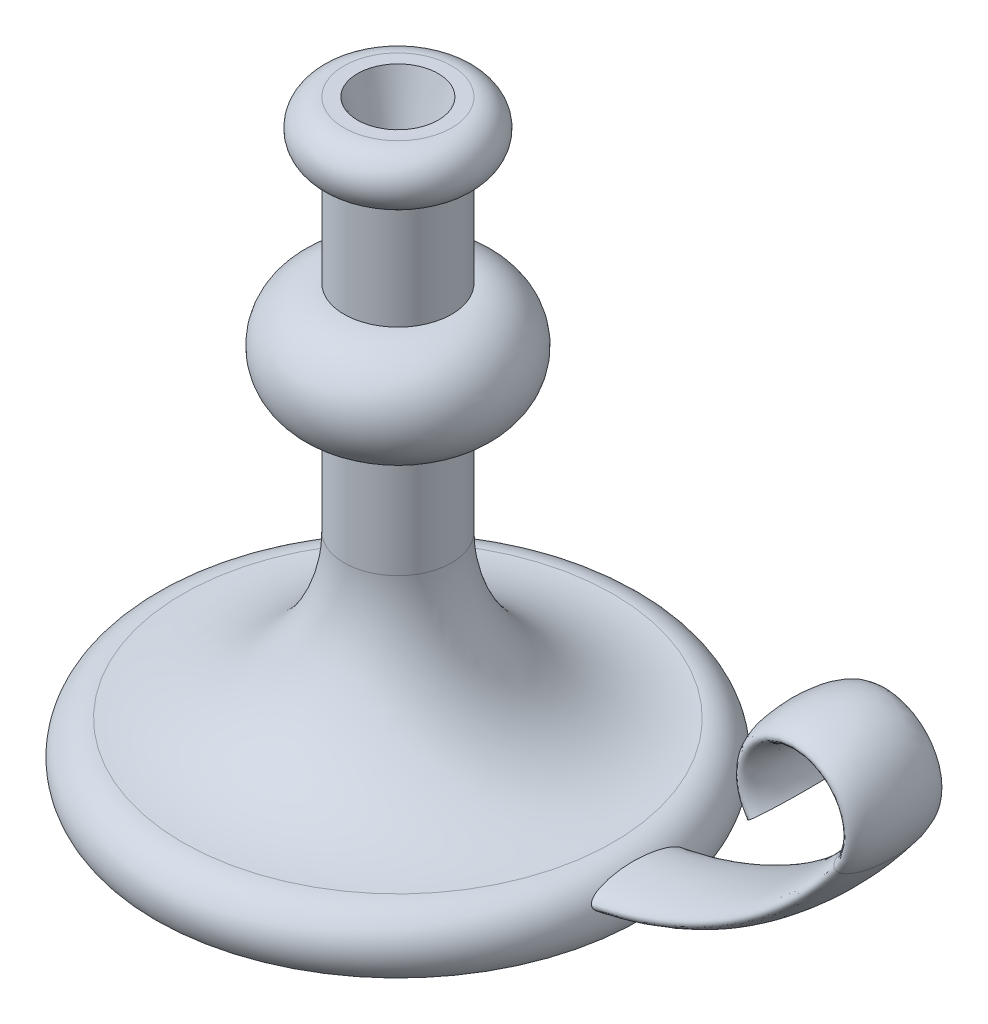
ISO-10303-21;
HEADER;
FILE_DESCRIPTION(('STEP AP214'),'2;1');
FILE_NAME('part.step','',(''),(''),'','','');
FILE_SCHEMA(('AUTOMOTIVE_DESIGN { 1 0 10303 214 1 1 1 1 }'));
ENDSEC;
DATA;
#1=APPLICATION_CONTEXT('core data for automotive mechanical design processes');
#2=APPLICATION_PROTOCOL_DEFINITION('international standard','automotive_design',2000,#1);
#3=PRODUCT_CONTEXT('',#1,'mechanical');
#4=PRODUCT('Part','Part','',(#3));
#5=PRODUCT_RELATED_PRODUCT_CATEGORY('part','',(#4));
#6=PRODUCT_DEFINITION_FORMATION('','',#4);
#7=PRODUCT_DEFINITION_CONTEXT('part definition',#1,'design');
#8=PRODUCT_DEFINITION('design','',#6,#7);
#9=PRODUCT_DEFINITION_SHAPE('','',#8);
#10=(LENGTH_UNIT() NAMED_UNIT(*) SI_UNIT(.MILLI.,.METRE.));
#11=(NAMED_UNIT(*) PLANE_ANGLE_UNIT() SI_UNIT($,.RADIAN.));
#12=(NAMED_UNIT(*) SI_UNIT($,.STERADIAN.) SOLID_ANGLE_UNIT());
#13=UNCERTAINTY_MEASURE_WITH_UNIT(LENGTH_MEASURE(1.E-05),#10,'distance_accuracy_value','');
#14=(GEOMETRIC_REPRESENTATION_CONTEXT(3) GLOBAL_UNCERTAINTY_ASSIGNED_CONTEXT((#13)) GLOBAL_UNIT_ASSIGNED_CONTEXT((#10,
#11,#12)) REPRESENTATION_CONTEXT('',''));
#15=CARTESIAN_POINT('',(0.,0.,0.));
#16=DIRECTION('',(0.,0.,1.));
#17=DIRECTION('',(1.,0.,0.));
#18=AXIS2_PLACEMENT_3D('',#15,#16,#17);
#19=CARTESIAN_POINT('',(90.,0.,0.));
#20=DIRECTION('',(0.,-1.,0.));
#21=DIRECTION('',(0.,0.,-1.));
#22=AXIS2_PLACEMENT_3D('',#19,#20,#21);
#23=PLANE('',#22);
#24=CARTESIAN_POINT('',(0.,0.,0.));
#25=DIRECTION('',(0.,-1.,0.));
#26=DIRECTION('',(0.,0.,-1.));
#27=AXIS2_PLACEMENT_3D('',#24,#25,#26);
#28=CIRCLE('',#27,90.);
#29=CARTESIAN_POINT('',(0.,0.,-90.));
#30=VERTEX_POINT('',#29);
#31=EDGE_CURVE('E77',#30,#30,#28,.T.);
#32=ORIENTED_EDGE('',*,*,#31,.T.);
#33=EDGE_LOOP('',(#32));
#34=FACE_BOUND('',#33,.T.);
#35=ADVANCED_FACE('F37',(#34),#23,.T.);
#36=CARTESIAN_POINT('',(0.,220.,0.));
#37=DIRECTION('',(0.,1.,0.));
#38=DIRECTION('',(0.,0.,1.));
#39=AXIS2_PLACEMENT_3D('',#36,#37,#38);
#40=PLANE('',#39);
#41=CARTESIAN_POINT('',(0.,220.,0.));
#42=DIRECTION('',(0.,1.,0.));
#43=DIRECTION('',(0.,0.,1.));
#44=AXIS2_PLACEMENT_3D('',#41,#42,#43);
#45=CIRCLE('',#44,15.);
#46=CARTESIAN_POINT('',(0.,220.,15.));
#47=VERTEX_POINT('',#46);
#48=EDGE_CURVE('E93',#47,#47,#45,.T.);
#49=ORIENTED_EDGE('',*,*,#48,.F.);
#50=EDGE_LOOP('',(#49));
#51=FACE_BOUND('',#50,.T.);
#52=CARTESIAN_POINT('',(0.,220.,0.));
#53=DIRECTION('',(0.,-1.,0.));
#54=DIRECTION('',(0.,0.,-1.));
#55=AXIS2_PLACEMENT_3D('',#52,#53,#54);
#56=CIRCLE('',#55,20.);
#57=CARTESIAN_POINT('',(0.,220.,-20.));
#58=VERTEX_POINT('',#57);
#59=EDGE_CURVE('E49',#58,#58,#56,.T.);
#60=ORIENTED_EDGE('',*,*,#59,.F.);
#61=EDGE_LOOP('',(#60));
#62=FACE_BOUND('',#61,.T.);
#63=ADVANCED_FACE('F100',(#51,#62),#40,.T.);
#64=CARTESIAN_POINT('',(0.,210.,0.));
#65=DIRECTION('',(0.,-1.,0.));
#66=DIRECTION('',(0.,0.,-1.));
#67=AXIS2_PLACEMENT_3D('',#64,#65,#66);
#68=TOROIDAL_SURFACE('',#67,20.,9.99999999999999);
#69=ORIENTED_EDGE('',*,*,#59,.T.);
#70=EDGE_LOOP('',(#69));
#71=FACE_BOUND('',#70,.T.);
#72=CARTESIAN_POINT('',(0.,200.,0.));
#73=DIRECTION('',(0.,-1.,0.));
#74=DIRECTION('',(0.,0.,-1.));
#75=AXIS2_PLACEMENT_3D('',#72,#73,#74);
#76=CIRCLE('',#75,20.);
#77=CARTESIAN_POINT('',(0.,200.,-20.));
#78=VERTEX_POINT('',#77);
#79=EDGE_CURVE('E54',#78,#78,#76,.T.);
#80=ORIENTED_EDGE('',*,*,#79,.F.);
#81=EDGE_LOOP('',(#80));
#82=FACE_BOUND('',#81,.T.);
#83=ADVANCED_FACE('F103',(#71,#82),#68,.T.);
#84=CARTESIAN_POINT('',(0.,0.,0.));
#85=DIRECTION('',(0.,-1.,0.));
#86=DIRECTION('',(0.,0.,-1.));
#87=AXIS2_PLACEMENT_3D('',#84,#85,#86);
#88=CYLINDRICAL_SURFACE('',#87,20.);
#89=ORIENTED_EDGE('',*,*,#79,.T.);
#90=EDGE_LOOP('',(#89));
#91=FACE_BOUND('',#90,.T.);
#92=CARTESIAN_POINT('',(0.,160.,0.));
#93=DIRECTION('',(0.,-1.,0.));
#94=DIRECTION('',(0.,0.,-1.));
#95=AXIS2_PLACEMENT_3D('',#92,#93,#94);
#96=CIRCLE('',#95,20.);
#97=CARTESIAN_POINT('',(0.,160.,-20.));
#98=VERTEX_POINT('',#97);
#99=EDGE_CURVE('E59',#98,#98,#96,.T.);
#100=ORIENTED_EDGE('',*,*,#99,.F.);
#101=EDGE_LOOP('',(#100));
#102=FACE_BOUND('',#101,.T.);
#103=ADVANCED_FACE('F108',(#91,#102),#88,.T.);
#104=CARTESIAN_POINT('',(0.,140.,0.));
#105=DIRECTION('',(0.,-1.,0.));
#106=DIRECTION('',(0.,0.,-1.));
#107=AXIS2_PLACEMENT_3D('',#104,#105,#106);
#108=TOROIDAL_SURFACE('',#107,20.,20.);
#109=ORIENTED_EDGE('',*,*,#99,.T.);
#110=EDGE_LOOP('',(#109));
#111=FACE_BOUND('',#110,.T.);
#112=CARTESIAN_POINT('',(0.,120.,0.));
#113=DIRECTION('',(0.,-1.,0.));
#114=DIRECTION('',(0.,0.,-1.));
#115=AXIS2_PLACEMENT_3D('',#112,#113,#114);
#116=CIRCLE('',#115,20.);
#117=CARTESIAN_POINT('',(0.,120.,-20.));
#118=VERTEX_POINT('',#117);
#119=EDGE_CURVE('E65',#118,#118,#116,.T.);
#120=ORIENTED_EDGE('',*,*,#119,.F.);
#121=EDGE_LOOP('',(#120));
#122=FACE_BOUND('',#121,.T.);
#123=ADVANCED_FACE('F114',(#111,#122),#108,.T.);
#124=CARTESIAN_POINT('',(0.,0.,0.));
#125=DIRECTION('',(0.,-1.,0.));
#126=DIRECTION('',(0.,0.,-1.));
#127=AXIS2_PLACEMENT_3D('',#124,#125,#126);
#128=CYLINDRICAL_SURFACE('',#127,20.);
#129=ORIENTED_EDGE('',*,*,#119,.T.);
#130=EDGE_LOOP('',(#129));
#131=FACE_BOUND('',#130,.T.);
#132=CARTESIAN_POINT('',(0.,80.,0.));
#133=DIRECTION('',(0.,-1.,0.));
#134=DIRECTION('',(0.,0.,-1.));
#135=AXIS2_PLACEMENT_3D('',#132,#133,#134);
#136=CIRCLE('',#135,20.);
#137=CARTESIAN_POINT('',(0.,80.,-20.));
#138=VERTEX_POINT('',#137);
#139=EDGE_CURVE('E69',#138,#138,#136,.T.);
#140=ORIENTED_EDGE('',*,*,#139,.F.);
#141=EDGE_LOOP('',(#140));
#142=FACE_BOUND('',#141,.T.);
#143=ADVANCED_FACE('F118',(#131,#142),#128,.T.);
#144=CARTESIAN_POINT('',(0.,80.,0.));
#145=DIRECTION('',(0.,-1.,0.));
#146=DIRECTION('',(0.,0.,-1.));
#147=AXIS2_PLACEMENT_3D('',#144,#145,#146);
#148=TOROIDAL_SURFACE('',#147,80.,60.);
#149=ORIENTED_EDGE('',*,*,#139,.T.);
#150=EDGE_LOOP('',(#149));
#151=FACE_BOUND('',#150,.T.);
#152=CARTESIAN_POINT('',(0.,20.,0.));
#153=DIRECTION('',(0.,-1.,0.));
#154=DIRECTION('',(0.,0.,-1.));
#155=AXIS2_PLACEMENT_3D('',#152,#153,#154);
#156=CIRCLE('',#155,80.);
#157=CARTESIAN_POINT('',(0.,20.,-80.));
#158=VERTEX_POINT('',#157);
#159=EDGE_CURVE('E73',#158,#158,#156,.T.);
#160=ORIENTED_EDGE('',*,*,#159,.F.);
#161=EDGE_LOOP('',(#160));
#162=FACE_BOUND('',#161,.T.);
#163=ADVANCED_FACE('F122',(#151,#162),#148,.F.);
#164=CARTESIAN_POINT('',(0.,7.50000000000001,0.));
#165=DIRECTION('',(0.,-1.,0.));
#166=DIRECTION('',(0.,0.,-1.));
#167=AXIS2_PLACEMENT_3D('',#164,#165,#166);
#168=TOROIDAL_SURFACE('',#167,80.,12.5);
#169=CARTESIAN_POINT('',(89.5597422043342,12.9414346567555,-17.5));
#170=CARTESIAN_POINT('',(89.5390618403562,12.9834100865229,-17.4999996776707));
#171=CARTESIAN_POINT('',(89.5184817634659,13.0254349004938,-17.4978446678338));
#172=CARTESIAN_POINT('',(89.4776811982744,13.1092324497794,-17.4892861575811));
#173=CARTESIAN_POINT('',(89.457460843071,13.1510050881611,-17.4828811168849));
#174=CARTESIAN_POINT('',(89.397540281121,13.2754779151414,-17.4575154450276));
#175=CARTESIAN_POINT('',(89.3585808220613,13.357332519418,-17.4324042670614));
#176=CARTESIAN_POINT('',(89.2734407804368,13.537917999339,-17.3597430943198));
#177=CARTESIAN_POINT('',(89.2281116968574,13.6353152430682,-17.3079906529225));
#178=CARTESIAN_POINT('',(89.1421567137609,13.8217570109409,-17.1881654215547));
#179=CARTESIAN_POINT('',(89.10154096816,13.9107834263932,-17.1200583326704));
#180=CARTESIAN_POINT('',(89.0298799325305,14.0690063055582,-16.9825317839868));
#181=CARTESIAN_POINT('',(88.9982856031081,14.1392491335227,-16.9145677994464));
#182=CARTESIAN_POINT('',(88.9378435588022,14.2742914925202,-16.7722502997375));
#183=CARTESIAN_POINT('',(88.9089980734781,14.3390866000317,-16.6978916893925));
#184=CARTESIAN_POINT('',(88.8536099995593,14.4639626152392,-16.5442177801531));
#185=CARTESIAN_POINT('',(88.8270733532936,14.5240313225779,-16.4648905452803));
#186=CARTESIAN_POINT('',(88.7760376587064,14.6398576639347,-16.3025863942461));
#187=CARTESIAN_POINT('',(88.7515379613228,14.6956166708123,-16.2196106536441));
#188=CARTESIAN_POINT('',(88.704732820549,14.8023169553036,-16.052427362784));
#189=CARTESIAN_POINT('',(88.6823939519366,14.8533308765833,-15.9682752160745));
#190=CARTESIAN_POINT('',(88.639155365759,14.9521540950118,-15.7977416210759));
#191=CARTESIAN_POINT('',(88.6182558899722,14.9999628537458,-15.711359801597));
#192=CARTESIAN_POINT('',(88.5573681790009,15.1392585624724,-15.4492483073625));
#193=CARTESIAN_POINT('',(88.5192579811328,15.2264609786255,-15.2707999543232));
#194=CARTESIAN_POINT('',(88.4468979005836,15.3916731276291,-14.9088289385944));
#195=CARTESIAN_POINT('',(88.4126513155026,15.4696750103546,-14.725302105289));
#196=CARTESIAN_POINT('',(88.347139159504,15.6182965032923,-14.3538259785736));
#197=CARTESIAN_POINT('',(88.3158872528146,15.6888824046966,-14.1658608782527));
#198=CARTESIAN_POINT('',(88.2560127035516,15.8233792512431,-13.7874003918539));
#199=CARTESIAN_POINT('',(88.2273872233002,15.8872974109117,-13.5969079973402));
#200=CARTESIAN_POINT('',(88.1723348827448,16.0094159388249,-13.213849673779));
#201=CARTESIAN_POINT('',(88.1459074726896,16.0676177374301,-13.021284276893));
#202=CARTESIAN_POINT('',(88.0884248304702,16.1932687928886,-12.5849658119247));
#203=CARTESIAN_POINT('',(88.0579162002184,16.2592725226906,-12.3407253521734));
#204=CARTESIAN_POINT('',(87.9994625659013,16.3844358500305,-11.8501803460781));
#205=CARTESIAN_POINT('',(87.9715178234088,16.4435947494061,-11.6038755919222));
#206=CARTESIAN_POINT('',(87.9178897421858,16.5558889779776,-11.1095299870479));
#207=CARTESIAN_POINT('',(87.8922075114269,16.6090213595568,-10.8614883492399));
#208=CARTESIAN_POINT('',(87.8429155378603,16.7098546386226,-10.3640943607017));
#209=CARTESIAN_POINT('',(87.8193058942812,16.7575552760879,-10.114741947821));
#210=CARTESIAN_POINT('',(87.7514718906047,16.8930622945828,-9.36631396644898));
#211=CARTESIAN_POINT('',(87.710111419914,16.97354616682,-8.86564202060313));
#212=CARTESIAN_POINT('',(87.6344118706353,17.1178657179368,-7.86153551840228));
#213=CARTESIAN_POINT('',(87.6000713341079,17.1817048544489,-7.35810155802564));
#214=CARTESIAN_POINT('',(87.5383679228554,17.2943697092708,-6.35225136111874));
#215=CARTESIAN_POINT('',(87.5109639050818,17.3432843238913,-5.84984753787557));
#216=CARTESIAN_POINT('',(87.4628391630611,17.4279603163538,-4.84354228831011));
#217=CARTESIAN_POINT('',(87.4421195253372,17.4637195559667,-4.33964063194091));
#218=CARTESIAN_POINT('',(87.4074386787955,17.5229738360405,-3.33084363886015));
#219=CARTESIAN_POINT('',(87.3934780874882,17.5464677559495,-2.82594821558682));
#220=CARTESIAN_POINT('',(87.3724154174235,17.5817273168609,-1.81615213380805));
#221=CARTESIAN_POINT('',(87.3653059747339,17.5935055508652,-1.31125206554522));
#222=CARTESIAN_POINT('',(87.3579750479625,17.6056484066489,-0.301318309132925));
#223=CARTESIAN_POINT('',(87.3577528582351,17.6060141977103,0.203715360026074));
#224=CARTESIAN_POINT('',(87.3641963426439,17.5953454261039,1.21356726554167));
#225=CARTESIAN_POINT('',(87.3708612610896,17.5843121142069,1.71838551945507));
#226=CARTESIAN_POINT('',(87.3886163883338,17.5546163065411,2.60695068649851));
#227=CARTESIAN_POINT('',(87.3982690399213,17.5384060734754,2.99081046478837));
#228=CARTESIAN_POINT('',(87.4214966880659,17.4990063104014,3.7580700278571));
#229=CARTESIAN_POINT('',(87.435071823598,17.4758165331044,4.14146979585426));
#230=CARTESIAN_POINT('',(87.4661109016121,17.4221255760208,4.90767543763207));
#231=CARTESIAN_POINT('',(87.4835755913649,17.3916229911934,5.29048118303757));
#232=CARTESIAN_POINT('',(87.52247652696,17.3226675403927,6.05728766608034));
#233=CARTESIAN_POINT('',(87.5439339089184,17.2841722314846,6.4412835383544));
#234=CARTESIAN_POINT('',(87.5907685418077,17.1987228636429,7.20803081067555));
#235=CARTESIAN_POINT('',(87.6161451191905,17.1517702579396,7.59078241304229));
#236=CARTESIAN_POINT('',(87.6708875244928,17.0486132676472,8.35453102594113));
#237=CARTESIAN_POINT('',(87.7002509792864,16.9924143825779,8.73552894189134));
#238=CARTESIAN_POINT('',(87.7555693385742,16.8844873931685,9.40362807317345));
#239=CARTESIAN_POINT('',(87.7806318626291,16.8349635590469,9.69115955865561));
#240=CARTESIAN_POINT('',(87.8333287645207,16.7293167465829,10.2648242071223));
#241=CARTESIAN_POINT('',(87.8609635304672,16.6731927720484,10.5509571522122));
#242=CARTESIAN_POINT('',(87.9190678138249,16.5534902310351,11.1217112831612));
#243=CARTESIAN_POINT('',(87.9495404231884,16.4899035134826,11.4063304543324));
#244=CARTESIAN_POINT('',(88.0137266324376,16.3541216812727,11.9738772339476));
#245=CARTESIAN_POINT('',(88.0474477220507,16.2819065762202,12.2567992545898));
#246=CARTESIAN_POINT('',(88.1183718381953,16.1280994435204,12.8175821097588));
#247=CARTESIAN_POINT('',(88.1555499028383,16.046573796357,13.0954641920682));
#248=CARTESIAN_POINT('',(88.2343580118385,15.8719007074313,13.6468218234687));
#249=CARTESIAN_POINT('',(88.2759857295859,15.7787593350285,13.9202995902182));
#250=CARTESIAN_POINT('',(88.3426568223939,15.628384040649,14.3254052817092));
#251=CARTESIAN_POINT('',(88.3655500017785,15.5765627213432,14.459402316928));
#252=CARTESIAN_POINT('',(88.4129882653633,15.4688611687535,14.7254525655375));
#253=CARTESIAN_POINT('',(88.4375331689951,15.4129813790936,14.8575059894887));
#254=CARTESIAN_POINT('',(88.4884967907572,15.296726972035,15.1188747284344));
#255=CARTESIAN_POINT('',(88.5149109123159,15.2363633637366,15.2481958098579));
#256=CARTESIAN_POINT('',(88.5700241751771,15.1103179001212,15.5037035642082));
#257=CARTESIAN_POINT('',(88.5987227483178,15.0446373670989,15.6298910063173));
#258=CARTESIAN_POINT('',(88.6570151826478,14.9113179601609,15.8704199707059));
#259=CARTESIAN_POINT('',(88.6864417367861,14.8440563407289,15.985009599526));
#260=CARTESIAN_POINT('',(88.7482816567768,14.7030103830827,16.2094581395952));
#261=CARTESIAN_POINT('',(88.7806974756141,14.6292206899981,16.3193130551169));
#262=CARTESIAN_POINT('',(88.8489097184972,14.4745639616531,16.5315146626623));
#263=CARTESIAN_POINT('',(88.8846785573508,14.3937550191611,16.6339121024916));
#264=CARTESIAN_POINT('',(88.9606113704153,14.2232561160767,16.8291907541922));
#265=CARTESIAN_POINT('',(89.0007675950254,14.1335818404865,16.9220882016582));
#266=CARTESIAN_POINT('',(89.0601235459873,14.0021924630805,17.0411637727684));
#267=CARTESIAN_POINT('',(89.0770574086405,13.9648250339927,17.073294917827));
#268=CARTESIAN_POINT('',(89.1117704043089,13.8885105828123,17.1351129203988));
#269=CARTESIAN_POINT('',(89.1295494801998,13.8495636674962,17.1647999427301));
#270=CARTESIAN_POINT('',(89.1842722230347,13.7301865324198,17.2496672583031));
#271=CARTESIAN_POINT('',(89.2225929343976,13.6472387371287,17.3006362954166));
#272=CARTESIAN_POINT('',(89.2830198855204,13.5177923286577,17.3659392171784));
#273=CARTESIAN_POINT('',(89.3038035106326,13.4734899832391,17.385944655127));
#274=CARTESIAN_POINT('',(89.3462357272131,13.3835498526412,17.421521231844));
#275=CARTESIAN_POINT('',(89.3678838017236,13.3379128698458,17.4370949768747));
#276=CARTESIAN_POINT('',(89.411904802424,13.2456714845448,17.4633118273198));
#277=CARTESIAN_POINT('',(89.4342765183816,13.1990687398024,17.4739627514632));
#278=CARTESIAN_POINT('',(89.4796070415906,13.1052444737537,17.4900003628641));
#279=CARTESIAN_POINT('',(89.5025657624808,13.0580230439623,17.495387819971));
#280=CARTESIAN_POINT('',(89.5464271716018,12.9684112208445,17.5004320668286));
#281=CARTESIAN_POINT('',(89.5672934245652,12.9260327119427,17.5006298436875));
#282=CARTESIAN_POINT('',(89.6091580078856,12.8415284156484,17.496667300483));
#283=CARTESIAN_POINT('',(89.6301563797468,12.7994027167221,17.4925055351934));
#284=CARTESIAN_POINT('',(89.672115635143,12.7157496198108,17.479965082583));
#285=CARTESIAN_POINT('',(89.6930765014329,12.6742224548789,17.4715847960013));
#286=CARTESIAN_POINT('',(89.7348115258834,12.5920532516239,17.450862522026));
#287=CARTESIAN_POINT('',(89.7555855765781,12.5514117057388,17.4385183877269));
#288=CARTESIAN_POINT('',(89.8013847331777,12.4623676182577,17.4070626989759));
#289=CARTESIAN_POINT('',(89.8263321178974,12.4142402057079,17.3870577635768));
#290=CARTESIAN_POINT('',(89.8756026524762,12.3198942829529,17.3423007335128));
#291=CARTESIAN_POINT('',(89.8999253272692,12.2736772101064,17.317545140678));
#292=CARTESIAN_POINT('',(89.9718636752115,12.1379719567039,17.2371059859825));
#293=CARTESIAN_POINT('',(90.0184026508767,12.051520920799,17.1752845379973));
#294=CARTESIAN_POINT('',(90.1015176697337,11.8991704299986,17.0502729237444));
#295=CARTESIAN_POINT('',(90.1385373685484,11.832138329749,16.9886971231214));
#296=CARTESIAN_POINT('',(90.2104869329279,11.7032426034952,16.8591573255862));
#297=CARTESIAN_POINT('',(90.2454151408799,11.641383062009,16.7911883686367));
#298=CARTESIAN_POINT('',(90.3133841124365,11.5222099067342,16.6502911436158));
#299=CARTESIAN_POINT('',(90.3464212107125,11.4649050425,16.577353807455));
#300=CARTESIAN_POINT('',(90.4107258034174,11.3544143267812,16.427734996584));
#301=CARTESIAN_POINT('',(90.441993749758,11.3012274221163,16.3510544874358));
#302=CARTESIAN_POINT('',(90.5066142435688,11.1922810586096,16.185318952537));
#303=CARTESIAN_POINT('',(90.5397652495639,11.1369814833086,16.0958847835331));
#304=CARTESIAN_POINT('',(90.6043042941241,11.0303194621557,15.9140859303205));
#305=CARTESIAN_POINT('',(90.6356921559875,10.978957410734,15.8217209538335));
#306=CARTESIAN_POINT('',(90.6968383877971,10.8797698841651,15.6347974994413));
#307=CARTESIAN_POINT('',(90.7265992701636,10.8319389137698,15.540242744142));
#308=CARTESIAN_POINT('',(90.7846969346252,10.7393295137681,15.3492353522605));
#309=CARTESIAN_POINT('',(90.8130337948204,10.6945509167067,15.2527828201663));
#310=CARTESIAN_POINT('',(90.8771212205239,10.5940589597549,15.0277319837683));
#311=CARTESIAN_POINT('',(90.9124022819658,10.5393328792865,14.8985593440141));
#312=CARTESIAN_POINT('',(90.9809741103801,10.4339610325184,14.6380328432609));
#313=CARTESIAN_POINT('',(91.0142645951402,10.3833158444317,14.5066786763347));
#314=CARTESIAN_POINT('',(91.1115171918213,10.2366440116077,14.109681091878));
#315=CARTESIAN_POINT('',(91.1727828792966,10.1460018602114,13.8413800425918));
#316=CARTESIAN_POINT('',(91.289286281246,9.97615455726913,13.2997906638458));
#317=CARTESIAN_POINT('',(91.3445203789088,9.89695625887036,13.0264994554535));
#318=CARTESIAN_POINT('',(91.449980571998,9.74769654866265,12.4748594155947));
#319=CARTESIAN_POINT('',(91.5001780442572,9.67768673078018,12.1964912536697));
#320=CARTESIAN_POINT('',(91.5957501918068,9.54592534416388,11.6372393425743));
#321=CARTESIAN_POINT('',(91.6411285723793,9.48416742117631,11.3563577087905));
#322=CARTESIAN_POINT('',(91.7275132616964,9.3677978716255,10.7925089006675));
#323=CARTESIAN_POINT('',(91.7685202729421,9.31318509647926,10.5095420692681));
#324=CARTESIAN_POINT('',(91.8503345045437,9.20520508711808,9.91387150213587));
#325=CARTESIAN_POINT('',(91.8907217744488,9.15249390095813,9.60099168323566));
#326=CARTESIAN_POINT('',(91.9669218199109,9.05389158705534,8.973596881819));
#327=CARTESIAN_POINT('',(92.002734366163,9.0080008011614,8.65908181815875));
#328=CARTESIAN_POINT('',(92.07003298894,8.92240020575309,8.02865568808709));
#329=CARTESIAN_POINT('',(92.1015177516249,8.88269227276197,7.71274422766424));
#330=CARTESIAN_POINT('',(92.1603325838503,8.80898713679307,7.0798662681054));
#331=CARTESIAN_POINT('',(92.1876625005419,8.77499014390501,6.76289973059328));
#332=CARTESIAN_POINT('',(92.263503001365,8.68114273902099,5.81249868362164));
#333=CARTESIAN_POINT('',(92.3060517448553,8.62919999492193,5.17778747193788));
#334=CARTESIAN_POINT('',(92.3760091017524,8.54431318450692,3.90627938186767));
#335=CARTESIAN_POINT('',(92.4034169750229,8.5113700469519,3.26948240305229));
#336=CARTESIAN_POINT('',(92.4435085691828,8.46331702284121,1.99545741778385));
#337=CARTESIAN_POINT('',(92.4562084043365,8.44818761908848,1.3582306498536));
#338=CARTESIAN_POINT('',(92.4671302630246,8.43517103988554,0.0834423270809372));
#339=CARTESIAN_POINT('',(92.4653514271759,8.43728488791034,-0.55411924538793));
#340=CARTESIAN_POINT('',(92.4472853754493,8.45883344750923,-1.82886328296974));
#341=CARTESIAN_POINT('',(92.4309954438924,8.47827140120329,-2.46604565478086));
#342=CARTESIAN_POINT('',(92.3836590626409,8.53514174464794,-3.73902583866995));
#343=CARTESIAN_POINT('',(92.3526140808133,8.5725723444522,-4.37482378215495));
#344=CARTESIAN_POINT('',(92.2921790866404,8.64621329194996,-5.36625544460969));
#345=CARTESIAN_POINT('',(92.2680118235608,8.6757873696348,-5.72271555901856));
#346=CARTESIAN_POINT('',(92.2147013952355,8.7414640473539,-6.43465819603286));
#347=CARTESIAN_POINT('',(92.1855583836333,8.77756644580537,-6.79014074847965));
#348=CARTESIAN_POINT('',(92.1221127048893,8.85679311513349,-7.49983836059465));
#349=CARTESIAN_POINT('',(92.0878103957549,8.89991689880821,-7.85405350646447));
#350=CARTESIAN_POINT('',(92.013798122625,8.99384143269647,-8.560897672239));
#351=CARTESIAN_POINT('',(91.9740883343958,9.04464193338978,-8.91352674331323));
#352=CARTESIAN_POINT('',(91.9015818240063,9.13842562293714,-9.51226790233095));
#353=CARTESIAN_POINT('',(91.8702370654071,9.17924629619433,-9.75889575934182));
#354=CARTESIAN_POINT('',(91.8045624920057,9.2655003663591,-10.25094196203));
#355=CARTESIAN_POINT('',(91.770232756707,9.31093364041767,-10.4963603397374));
#356=CARTESIAN_POINT('',(91.6984266463272,9.40685898724879,-10.9855805665734));
#357=CARTESIAN_POINT('',(91.6609523533817,9.45734771681963,-11.2293833718166));
#358=CARTESIAN_POINT('',(91.5826038967892,9.56401317099023,-11.7151775621046));
#359=CARTESIAN_POINT('',(91.5417298772536,9.62018965451311,-11.9571690234574));
#360=CARTESIAN_POINT('',(91.4386423376746,9.76351210996381,-12.5384162018483));
#361=CARTESIAN_POINT('',(91.3745858903288,9.85386844470743,-12.876578655777));
#362=CARTESIAN_POINT('',(91.2720163238267,10.0014015523806,-13.3793136041311));
#363=CARTESIAN_POINT('',(91.2367090969993,10.0526332971693,-13.5462966135006));
#364=CARTESIAN_POINT('',(91.1637294936457,10.1596261841618,-13.8782853379554));
#365=CARTESIAN_POINT('',(91.1260572231721,10.2153871233019,-14.0432911413073));
#366=CARTESIAN_POINT('',(91.0448513753996,10.3369382727868,-14.3844416693128));
#367=CARTESIAN_POINT('',(91.0010908407915,10.4031767890598,-14.5603739146114));
#368=CARTESIAN_POINT('',(90.9100440331646,10.5428509324198,-14.9085311659831));
#369=CARTESIAN_POINT('',(90.8627565865346,10.6162889577863,-15.0807549132313));
#370=CARTESIAN_POINT('',(90.7642492199854,10.7715651970482,-15.4195496037303));
#371=CARTESIAN_POINT('',(90.7130423069867,10.8533759065569,-15.5861368065585));
#372=CARTESIAN_POINT('',(90.6058220172113,11.027534891643,-15.9120386126949));
#373=CARTESIAN_POINT('',(90.5498128203451,11.1198740259081,-16.0713593593323));
#374=CARTESIAN_POINT('',(90.444408289305,11.2969255920341,-16.346591008204));
#375=CARTESIAN_POINT('',(90.3961277047704,11.3791055101425,-16.4645448336189));
#376=CARTESIAN_POINT('',(90.2950977924847,11.5538633486867,-16.6911566146551));
#377=CARTESIAN_POINT('',(90.242339056253,11.6464633011953,-16.7997939840167));
#378=CARTESIAN_POINT('',(90.1590440243456,11.7953014200273,-16.9524870890686));
#379=CARTESIAN_POINT('',(90.1303607600847,11.8469859215398,-17.0019977189781));
#380=CARTESIAN_POINT('',(90.0716181087375,11.9538274561511,-17.0963102611099));
#381=CARTESIAN_POINT('',(90.0415584049394,12.0089852895524,-17.1411110817339));
#382=CARTESIAN_POINT('',(89.9801756575596,12.122724663209,-17.2246441347398));
#383=CARTESIAN_POINT('',(89.9488577537651,12.181292641625,-17.2633984155373));
#384=CARTESIAN_POINT('',(89.8849549671329,12.3020144005062,-17.3335784406431));
#385=CARTESIAN_POINT('',(89.8523712452273,12.3641649194656,-17.3650107233705));
#386=CARTESIAN_POINT('',(89.7981176909034,12.4687258013536,-17.4092508881815));
#387=CARTESIAN_POINT('',(89.7767436177655,12.5101841078546,-17.4246893204628));
#388=CARTESIAN_POINT('',(89.7336969050674,12.5942336377178,-17.4515182330193));
#389=CARTESIAN_POINT('',(89.7120243813912,12.636824427018,-17.4629102408532));
#390=CARTESIAN_POINT('',(89.6685521390583,12.7228207531292,-17.4812886417918));
#391=CARTESIAN_POINT('',(89.6467526103346,12.766225219827,-17.488280453409));
#392=CARTESIAN_POINT('',(89.6031794397246,12.8535466229688,-17.4976362320133));
#393=CARTESIAN_POINT('',(89.5814057970823,12.8974635440192,-17.5000003376542));
#394=CARTESIAN_POINT('',(89.5597422043342,12.9414346567555,-17.5));
#395=B_SPLINE_CURVE_WITH_KNOTS('',3,(#169,#170,#171,#172,#173,#174,#175,#176,#177,#178,#179,
#180,#181,#182,#183,#184,#185,#186,#187,#188,#189,#190,#191,#192,#193,#194,#195,#196,#197,#198,
#199,#200,#201,#202,#203,#204,#205,#206,#207,#208,#209,#210,#211,#212,#213,#214,#215,#216,#217,
#218,#219,#220,#221,#222,#223,#224,#225,#226,#227,#228,#229,#230,#231,#232,#233,#234,#235,#236,
#237,#238,#239,#240,#241,#242,#243,#244,#245,#246,#247,#248,#249,#250,#251,#252,#253,#254,#255,
#256,#257,#258,#259,#260,#261,#262,#263,#264,#265,#266,#267,#268,#269,#270,#271,#272,#273,#274,
#275,#276,#277,#278,#279,#280,#281,#282,#283,#284,#285,#286,#287,#288,#289,#290,#291,#292,#293,
#294,#295,#296,#297,#298,#299,#300,#301,#302,#303,#304,#305,#306,#307,#308,#309,#310,#311,#312,
#313,#314,#315,#316,#317,#318,#319,#320,#321,#322,#323,#324,#325,#326,#327,#328,#329,#330,#331,
#332,#333,#334,#335,#336,#337,#338,#339,#340,#341,#342,#343,#344,#345,#346,#347,#348,#349,#350,
#351,#352,#353,#354,#355,#356,#357,#358,#359,#360,#361,#362,#363,#364,#365,#366,#367,#368,#369,
#370,#371,#372,#373,#374,#375,#376,#377,#378,#379,#380,#381,#382,#383,#384,#385,#386,#387,#388,
#389,#390,#391,#392,#393,#394),.UNSPECIFIED.,.T.,.F.,(4,2,2,2,2,2,2,2,2,2,2,2,2,2,2,2,2,2,2,2,2,
2,2,2,2,2,2,2,2,2,2,2,2,2,2,2,2,2,2,2,2,2,2,2,2,2,2,2,2,2,2,2,2,2,2,2,2,2,2,2,2,2,2,2,2,2,2,2,2,
2,2,2,2,2,2,2,2,2,2,2,2,2,2,2,2,2,2,2,2,2,2,2,2,2,2,2,2,2,2,2,2,2,2,2,2,2,2,2,2,2,2,2,4),(0.,
0.140326879649315,0.280704643844319,0.56146180649995,0.917225717585816,1.27374235386085,
1.58146302398147,1.88943119593642,2.19816989275476,2.50680983170026,2.80944292372751,
3.11212672643257,3.71838915770194,4.32516518168248,4.93458970782544,5.54334784093538,
6.15195325906649,6.91631911029045,7.68076285707087,8.44557890144726,9.2104315427113,
10.7363530227227,12.2619572680851,13.7782885580523,15.2948661984783,16.8115823682402,
18.3266664767784,19.8415953542035,21.3563580231468,22.5092504482307,23.6621837256808,
24.8153386988898,25.9747813799631,27.1340250219354,28.2925816429425,29.1710242088838,
30.0495995331114,30.9291435591542,31.8107663507034,32.6864555684207,33.5616891298975,
33.9980703124477,34.4344038665402,34.8696994156046,35.304887039303,35.7129485465613,
36.1213479397352,36.5266413619584,36.9312301321629,37.087481072601,37.2437214677037,
37.5562829439449,37.7147148343191,37.8730533580126,38.0311395270883,38.1892025705741,
38.3307149014328,38.4722741597123,38.6138871242241,38.7555769191151,38.9286541005773,
39.1018592207181,39.4485901352339,39.7429975955386,40.0376353818191,40.3328261359407,
40.6279411430422,40.9585479808935,41.289187893173,41.6193018978016,41.949397777569,
42.38325515086,42.817173888797,43.6859467918768,44.5552378220702,45.4292182663363,
46.3025217875281,47.1756847521813,48.1351081860334,49.0945796914523,50.0543418354863,
51.0141392787935,52.9283366636013,54.8426276125086,56.7548192562814,58.6671243992166,
60.5797874956866,62.4922603557699,63.5676819321851,64.6430703071876,65.7183840946028,
66.7936629380625,67.5494303160604,68.3051775707192,69.0604283053777,69.8156470419353,
70.8826765887352,71.4172057561799,71.9517109715329,72.5305894861727,73.1096614946434,
73.6868888443993,74.2636187787013,74.7180950553376,75.1735510009089,75.4046853668802,
75.6358731855896,75.8661972266866,76.0963147970918,76.2435550398535,76.3907396389803,
76.5377426347989,76.6847412260987),.UNSPECIFIED.);
#396=CARTESIAN_POINT('',(89.5597422043342,12.9414346567555,-17.5));
#397=VERTEX_POINT('',#396);
#398=EDGE_CURVE('E10',#397,#397,#395,.T.);
#399=ORIENTED_EDGE('',*,*,#398,.F.);
#400=EDGE_LOOP('',(#399));
#401=FACE_BOUND('',#400,.T.);
#402=ORIENTED_EDGE('',*,*,#159,.T.);
#403=EDGE_LOOP('',(#402));
#404=FACE_BOUND('',#403,.T.);
#405=ORIENTED_EDGE('',*,*,#31,.F.);
#406=EDGE_LOOP('',(#405));
#407=FACE_BOUND('',#406,.T.);
#408=ADVANCED_FACE('F125',(#401,#404,#407),#168,.T.);
#409=CARTESIAN_POINT('',(148.,70.,0.));
#410=DIRECTION('',(0.6,-0.8,0.));
#411=DIRECTION('',(0.,0.,-1.));
#412=AXIS2_PLACEMENT_3D('',#409,#410,#411);
#413=PLANE('',#412);
#414=CARTESIAN_POINT('',(148.,70.,0.));
#415=DIRECTION('',(0.6,-0.8,0.));
#416=DIRECTION('',(0.,0.,-1.));
#417=AXIS2_PLACEMENT_3D('',#414,#415,#416);
#418=ELLIPSE('',#417,17.5,5.);
#419=CARTESIAN_POINT('',(148.,70.,-17.5));
#420=VERTEX_POINT('',#419);
#421=EDGE_CURVE('E81',#420,#420,#418,.T.);
#422=ORIENTED_EDGE('',*,*,#421,.T.);
#423=EDGE_LOOP('',(#422));
#424=FACE_BOUND('',#423,.T.);
#425=ADVANCED_FACE('F130',(#424),#413,.T.);
#426=CARTESIAN_POINT('',(60.,10.,-17.5));
#427=CARTESIAN_POINT('',(108.107236977278,10.,-17.5));
#428=CARTESIAN_POINT('',(151.135657813633,31.5142104181772,-17.5));
#429=CARTESIAN_POINT('',(180.,70.,-17.5));
#430=CARTESIAN_POINT('',(60.,20.,-17.5));
#431=CARTESIAN_POINT('',(104.90008784546,20.,-17.5));
#432=CARTESIAN_POINT('',(145.059947292724,40.0799297236321,-17.5));
#433=CARTESIAN_POINT('',(172.,76.,-17.5));
#434=CARTESIAN_POINT('',(60.,20.,17.5));
#435=CARTESIAN_POINT('',(104.90008784546,20.,17.5));
#436=CARTESIAN_POINT('',(145.059947292724,40.0799297236321,17.5));
#437=CARTESIAN_POINT('',(172.,76.,17.5));
#438=CARTESIAN_POINT('',(60.,10.,17.5));
#439=CARTESIAN_POINT('',(108.107236977278,10.,17.5));
#440=CARTESIAN_POINT('',(151.135657813633,31.5142104181772,17.5));
#441=CARTESIAN_POINT('',(180.,70.,17.5));
#442=CARTESIAN_POINT('',(60.,0.,17.5));
#443=CARTESIAN_POINT('',(111.314386109097,0.,17.5));
#444=CARTESIAN_POINT('',(157.211368334542,22.9484911127224,17.5));
#445=CARTESIAN_POINT('',(188.,64.,17.5));
#446=CARTESIAN_POINT('',(60.,0.,-17.5));
#447=CARTESIAN_POINT('',(111.314386109097,0.,-17.5));
#448=CARTESIAN_POINT('',(157.211368334542,22.9484911127224,-17.5));
#449=CARTESIAN_POINT('',(188.,64.,-17.5));
#450=CARTESIAN_POINT('',(60.,10.,-17.5));
#451=CARTESIAN_POINT('',(108.107236977278,10.,-17.5));
#452=CARTESIAN_POINT('',(151.135657813633,31.5142104181772,-17.5));
#453=CARTESIAN_POINT('',(180.,70.,-17.5));
#454=(BOUNDED_SURFACE() B_SPLINE_SURFACE(3,3,((#426,#427,#428,#429),(#430,#431,#432,#433),(#434,
#435,#436,#437),(#438,#439,#440,#441),(#442,#443,#444,#445),(#446,#447,#448,#449),(#450,#451,
#452,#453)),.UNSPECIFIED.,.T.,.F.,.F.) B_SPLINE_SURFACE_WITH_KNOTS((4,3,4),(4,4),(0.,0.5,1.),
(0.,1.),.UNSPECIFIED.) GEOMETRIC_REPRESENTATION_ITEM() RATIONAL_B_SPLINE_SURFACE(((1.,
0.929618127333277,0.929618127333277,1.),(0.333333333333333,0.309872709111092,0.309872709111092,
0.333333333333333),(0.333333333333333,0.309872709111092,0.309872709111092,0.333333333333333),
(1.,0.929618127333277,0.929618127333277,1.),(0.333333333333333,0.309872709111092,
0.309872709111092,0.333333333333333),(0.333333333333333,0.309872709111092,0.309872709111092,
0.333333333333333),(1.,0.929618127333277,0.929618127333277,1.))) REPRESENTATION_ITEM('') SURFACE());
#455=CARTESIAN_POINT('',(180.,70.,0.));
#456=DIRECTION('',(0.6,0.8,0.));
#457=DIRECTION('',(0.,0.,-1.));
#458=AXIS2_PLACEMENT_3D('',#455,#456,#457);
#459=ELLIPSE('',#458,17.5,5.);
#460=CARTESIAN_POINT('',(180.,70.,-17.5));
#461=VERTEX_POINT('',#460);
#462=EDGE_CURVE('E85',#461,#461,#459,.T.);
#463=ORIENTED_EDGE('',*,*,#398,.T.);
#464=EDGE_LOOP('',(#463));
#465=FACE_BOUND('',#464,.T.);
#466=ORIENTED_EDGE('',*,*,#462,.F.);
#467=EDGE_LOOP('',(#466));
#468=FACE_BOUND('',#467,.T.);
#469=ADVANCED_FACE('F135',(#465,#468),#454,.T.);
#470=CARTESIAN_POINT('',(180.,70.,-17.5));
#471=CARTESIAN_POINT('',(191.33126291999,85.1083505599865,-17.5));
#472=CARTESIAN_POINT('',(182.885438199983,102.,-17.5));
#473=CARTESIAN_POINT('',(164.,102.,-17.5));
#474=CARTESIAN_POINT('',(145.114561800017,102.,-17.5));
#475=CARTESIAN_POINT('',(136.66873708001,85.1083505599866,-17.5));
#476=CARTESIAN_POINT('',(148.,70.,-17.5));
#477=CARTESIAN_POINT('',(172.,76.,-17.5));
#478=CARTESIAN_POINT('',(177.665631459995,83.5541752799933,-17.5));
#479=CARTESIAN_POINT('',(173.442719099992,92.,-17.5));
#480=CARTESIAN_POINT('',(164.,92.,-17.5));
#481=CARTESIAN_POINT('',(154.557280900008,92.,-17.5));
#482=CARTESIAN_POINT('',(150.334368540005,83.5541752799932,-17.5));
#483=CARTESIAN_POINT('',(156.,76.,-17.5));
#484=CARTESIAN_POINT('',(172.,76.,17.5));
#485=CARTESIAN_POINT('',(177.665631459995,83.5541752799933,17.5));
#486=CARTESIAN_POINT('',(173.442719099992,92.,17.5));
#487=CARTESIAN_POINT('',(164.,92.,17.5));
#488=CARTESIAN_POINT('',(154.557280900008,92.,17.5));
#489=CARTESIAN_POINT('',(150.334368540005,83.5541752799932,17.5));
#490=CARTESIAN_POINT('',(156.,76.,17.5));
#491=CARTESIAN_POINT('',(180.,70.,17.5));
#492=CARTESIAN_POINT('',(191.33126291999,85.1083505599865,17.5));
#493=CARTESIAN_POINT('',(182.885438199983,102.,17.5));
#494=CARTESIAN_POINT('',(164.,102.,17.5));
#495=CARTESIAN_POINT('',(145.114561800017,102.,17.5));
#496=CARTESIAN_POINT('',(136.66873708001,85.1083505599866,17.5));
#497=CARTESIAN_POINT('',(148.,70.,17.5));
#498=CARTESIAN_POINT('',(188.,64.,17.5));
#499=CARTESIAN_POINT('',(204.996894379985,86.6625258399798,17.5));
#500=CARTESIAN_POINT('',(192.328157299975,112.,17.5));
#501=CARTESIAN_POINT('',(164.,112.,17.5));
#502=CARTESIAN_POINT('',(135.671842700025,112.,17.5));
#503=CARTESIAN_POINT('',(123.003105620015,86.6625258399798,17.5));
#504=CARTESIAN_POINT('',(140.,64.,17.5));
#505=CARTESIAN_POINT('',(188.,64.,-17.5));
#506=CARTESIAN_POINT('',(204.996894379985,86.6625258399798,-17.5));
#507=CARTESIAN_POINT('',(192.328157299975,112.,-17.5));
#508=CARTESIAN_POINT('',(164.,112.,-17.5));
#509=CARTESIAN_POINT('',(135.671842700025,112.,-17.5));
#510=CARTESIAN_POINT('',(123.003105620015,86.6625258399798,-17.5));
#511=CARTESIAN_POINT('',(140.,64.,-17.5));
#512=CARTESIAN_POINT('',(180.,70.,-17.5));
#513=CARTESIAN_POINT('',(191.33126291999,85.1083505599865,-17.5));
#514=CARTESIAN_POINT('',(182.885438199983,102.,-17.5));
#515=CARTESIAN_POINT('',(164.,102.,-17.5));
#516=CARTESIAN_POINT('',(145.114561800017,102.,-17.5));
#517=CARTESIAN_POINT('',(136.66873708001,85.1083505599866,-17.5));
#518=CARTESIAN_POINT('',(148.,70.,-17.5));
#519=(BOUNDED_SURFACE() B_SPLINE_SURFACE(3,3,((#470,#471,#472,#473,#474,#475,#476),(#477,#478,
#479,#480,#481,#482,#483),(#484,#485,#486,#487,#488,#489,#490),(#491,#492,#493,#494,#495,#496,
#497),(#498,#499,#500,#501,#502,#503,#504),(#505,#506,#507,#508,#509,#510,#511),(#512,#513,#514,
#515,#516,#517,#518)),.UNSPECIFIED.,.T.,.F.,.F.) B_SPLINE_SURFACE_WITH_KNOTS((4,3,4),(4,3,4),
(0.,0.5,1.),(0.,0.5,1.),
.UNSPECIFIED.) GEOMETRIC_REPRESENTATION_ITEM() RATIONAL_B_SPLINE_SURFACE(((1.,0.631475730333305,
0.631475730333305,1.,0.631475730333305,0.631475730333305,1.),(0.333333333333333,
0.210491910111102,0.210491910111102,0.333333333333333,0.210491910111102,0.210491910111102,
0.333333333333333),(0.333333333333333,0.210491910111102,0.210491910111102,0.333333333333333,
0.210491910111102,0.210491910111102,0.333333333333333),(1.,0.631475730333305,0.631475730333305,
1.,0.631475730333305,0.631475730333305,1.),(0.333333333333333,0.210491910111102,
0.210491910111102,0.333333333333333,0.210491910111102,0.210491910111102,0.333333333333333),
(0.333333333333333,0.210491910111102,0.210491910111102,0.333333333333333,0.210491910111102,
0.210491910111102,0.333333333333333),(1.,0.631475730333305,0.631475730333305,1.,
0.631475730333305,0.631475730333305,1.))) REPRESENTATION_ITEM('') SURFACE());
#520=ORIENTED_EDGE('',*,*,#421,.F.);
#521=EDGE_LOOP('',(#520));
#522=FACE_BOUND('',#521,.T.);
#523=ORIENTED_EDGE('',*,*,#462,.T.);
#524=EDGE_LOOP('',(#523));
#525=FACE_BOUND('',#524,.T.);
#526=ADVANCED_FACE('F132',(#522,#525),#519,.T.);
#527=CARTESIAN_POINT('',(0.,220.,0.));
#528=DIRECTION('',(0.,1.,0.));
#529=DIRECTION('',(0.,0.,1.));
#530=AXIS2_PLACEMENT_3D('',#527,#528,#529);
#531=CONICAL_SURFACE('',#530,15.,0.26179938779915);
#532=CARTESIAN_POINT('',(0.,195.,0.));
#533=DIRECTION('',(0.,1.,0.));
#534=DIRECTION('',(0.,0.,1.));
#535=AXIS2_PLACEMENT_3D('',#532,#533,#534);
#536=CIRCLE('',#535,8.30127018922192);
#537=CARTESIAN_POINT('',(0.,195.,8.30127018922192));
#538=VERTEX_POINT('',#537);
#539=EDGE_CURVE('E89',#538,#538,#536,.T.);
#540=ORIENTED_EDGE('',*,*,#539,.F.);
#541=EDGE_LOOP('',(#540));
#542=FACE_BOUND('',#541,.T.);
#543=ORIENTED_EDGE('',*,*,#48,.T.);
#544=EDGE_LOOP('',(#543));
#545=FACE_BOUND('',#544,.T.);
#546=ADVANCED_FACE('F98',(#542,#545),#531,.F.);
#547=CARTESIAN_POINT('',(0.,195.,0.));
#548=DIRECTION('',(0.,1.,0.));
#549=DIRECTION('',(0.,0.,1.));
#550=AXIS2_PLACEMENT_3D('',#547,#548,#549);
#551=PLANE('',#550);
#552=ORIENTED_EDGE('',*,*,#539,.T.);
#553=EDGE_LOOP('',(#552));
#554=FACE_BOUND('',#553,.T.);
#555=ADVANCED_FACE('F158',(#554),#551,.T.);
#556=CLOSED_SHELL('',(#35,#63,#83,#103,#123,#143,#163,#408,#425,#469,#526,#546,#555));
#557=MANIFOLD_SOLID_BREP('B2',#556);
#558=ADVANCED_BREP_SHAPE_REPRESENTATION('',(#18,#557),#14);
#559=SHAPE_DEFINITION_REPRESENTATION(#9,#558);
ENDSEC;
END-ISO-10303-21;
